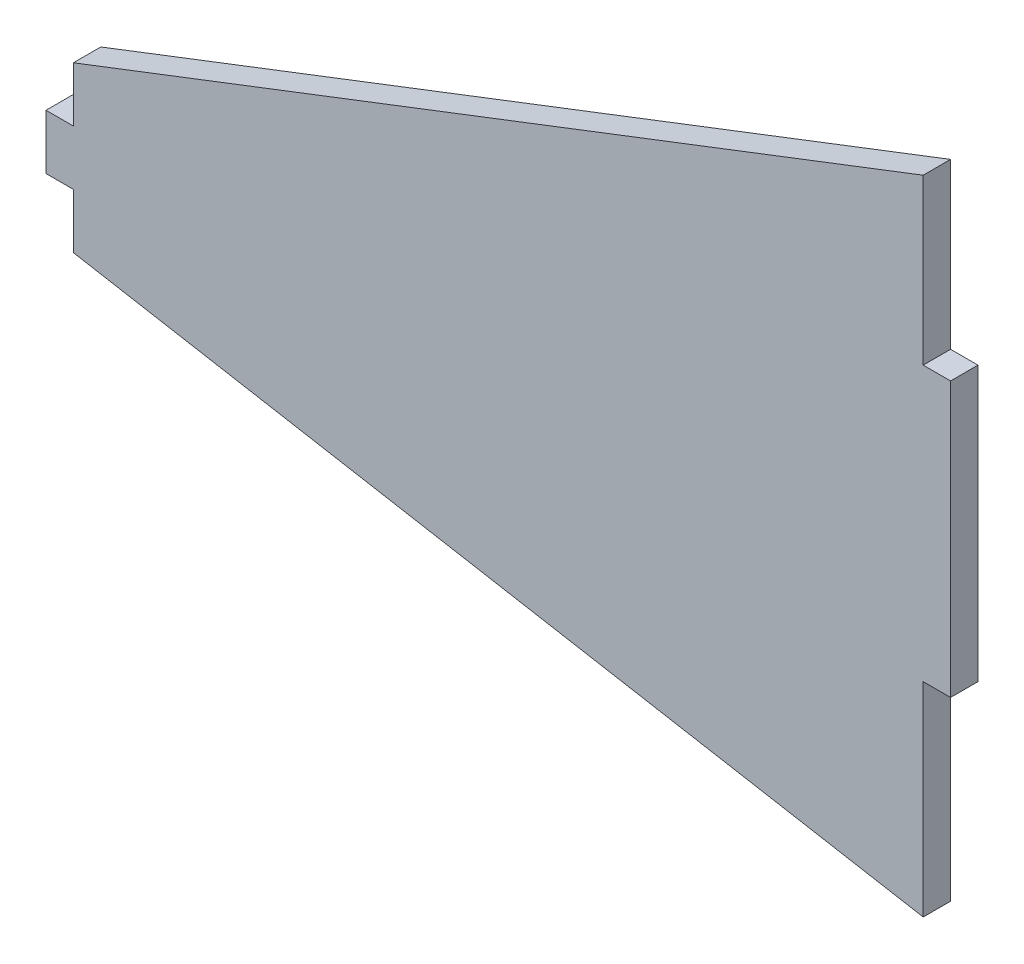
ISO-10303-21;
HEADER;
FILE_DESCRIPTION(('STEP AP214'),'2;1');
FILE_NAME('part.step','',(''),(''),'','','');
FILE_SCHEMA(('AUTOMOTIVE_DESIGN { 1 0 10303 214 1 1 1 1 }'));
ENDSEC;
DATA;
#1=APPLICATION_CONTEXT('core data for automotive mechanical design processes');
#2=APPLICATION_PROTOCOL_DEFINITION('international standard','automotive_design',2000,#1);
#3=PRODUCT_CONTEXT('',#1,'mechanical');
#4=PRODUCT('Part','Part','',(#3));
#5=PRODUCT_RELATED_PRODUCT_CATEGORY('part','',(#4));
#6=PRODUCT_DEFINITION_FORMATION('','',#4);
#7=PRODUCT_DEFINITION_CONTEXT('part definition',#1,'design');
#8=PRODUCT_DEFINITION('design','',#6,#7);
#9=PRODUCT_DEFINITION_SHAPE('','',#8);
#10=(LENGTH_UNIT() NAMED_UNIT(*) SI_UNIT(.MILLI.,.METRE.));
#11=(NAMED_UNIT(*) PLANE_ANGLE_UNIT() SI_UNIT($,.RADIAN.));
#12=(NAMED_UNIT(*) SI_UNIT($,.STERADIAN.) SOLID_ANGLE_UNIT());
#13=UNCERTAINTY_MEASURE_WITH_UNIT(LENGTH_MEASURE(1.E-05),#10,'distance_accuracy_value','');
#14=(GEOMETRIC_REPRESENTATION_CONTEXT(3) GLOBAL_UNCERTAINTY_ASSIGNED_CONTEXT((#13)) GLOBAL_UNIT_ASSIGNED_CONTEXT((#10,
#11,#12)) REPRESENTATION_CONTEXT('',''));
#15=CARTESIAN_POINT('',(0.,0.,0.));
#16=DIRECTION('',(0.,0.,1.));
#17=DIRECTION('',(1.,0.,0.));
#18=AXIS2_PLACEMENT_3D('',#15,#16,#17);
#19=CARTESIAN_POINT('',(0.,0.,3.175));
#20=DIRECTION('',(-1.,0.,0.));
#21=DIRECTION('',(0.,-1.,0.));
#22=AXIS2_PLACEMENT_3D('',#19,#20,#21);
#23=PLANE('',#22);
#24=DIRECTION('',(0.,1.,0.));
#25=VECTOR('',#24,1.);
#26=CARTESIAN_POINT('',(0.,0.,0.));
#27=LINE('',#26,#25);
#28=CARTESIAN_POINT('',(0.,3.175,0.));
#29=VERTEX_POINT('',#28);
#30=CARTESIAN_POINT('',(0.,9.525,0.));
#31=VERTEX_POINT('',#30);
#32=EDGE_CURVE('E62',#29,#31,#27,.T.);
#33=ORIENTED_EDGE('',*,*,#32,.F.);
#34=DIRECTION('',(0.,0.,1.));
#35=VECTOR('',#34,1.);
#36=CARTESIAN_POINT('',(0.,3.175,-7.09951582856183));
#37=LINE('',#36,#35);
#38=CARTESIAN_POINT('',(0.,3.175,3.175));
#39=VERTEX_POINT('',#38);
#40=EDGE_CURVE('E57',#29,#39,#37,.T.);
#41=ORIENTED_EDGE('',*,*,#40,.T.);
#42=DIRECTION('',(0.,1.,0.));
#43=VECTOR('',#42,1.);
#44=CARTESIAN_POINT('',(0.,0.,3.175));
#45=LINE('',#44,#43);
#46=CARTESIAN_POINT('',(0.,9.525,3.175));
#47=VERTEX_POINT('',#46);
#48=EDGE_CURVE('E154',#39,#47,#45,.T.);
#49=ORIENTED_EDGE('',*,*,#48,.T.);
#50=DIRECTION('',(0.,0.,-1.));
#51=VECTOR('',#50,1.);
#52=CARTESIAN_POINT('',(0.,9.525,3.175));
#53=LINE('',#52,#51);
#54=EDGE_CURVE('E231',#47,#31,#53,.T.);
#55=ORIENTED_EDGE('',*,*,#54,.T.);
#56=EDGE_LOOP('',(#33,#41,#49,#55));
#57=FACE_BOUND('',#56,.T.);
#58=ADVANCED_FACE('F41',(#57),#23,.T.);
#59=CARTESIAN_POINT('',(-1.63543542774568,-9.2353913704308,3.175));
#60=DIRECTION('',(-0.174370598056504,-0.984680097561343,0.));
#61=DIRECTION('',(0.984680097561344,-0.174370598056504,0.));
#62=AXIS2_PLACEMENT_3D('',#59,#60,#61);
#63=PLANE('',#62);
#64=DIRECTION('',(-0.984680097561344,0.174370598056504,0.));
#65=VECTOR('',#64,1.);
#66=CARTESIAN_POINT('',(-1.63543542774568,-9.2353913704308,0.));
#67=LINE('',#66,#65);
#68=CARTESIAN_POINT('',(98.425,-26.9544434875,0.));
#69=VERTEX_POINT('',#68);
#70=CARTESIAN_POINT('',(0.,-9.525,0.));
#71=VERTEX_POINT('',#70);
#72=EDGE_CURVE('E174',#69,#71,#67,.T.);
#73=ORIENTED_EDGE('',*,*,#72,.F.);
#74=DIRECTION('',(0.,0.,-1.));
#75=VECTOR('',#74,1.);
#76=CARTESIAN_POINT('',(98.425,-26.9544434875,3.175));
#77=LINE('',#76,#75);
#78=CARTESIAN_POINT('',(98.425,-26.9544434875,3.175));
#79=VERTEX_POINT('',#78);
#80=EDGE_CURVE('E11',#79,#69,#77,.T.);
#81=ORIENTED_EDGE('',*,*,#80,.F.);
#82=DIRECTION('',(-0.984680097561344,0.174370598056504,0.));
#83=VECTOR('',#82,1.);
#84=CARTESIAN_POINT('',(-1.63543542774568,-9.2353913704308,3.175));
#85=LINE('',#84,#83);
#86=CARTESIAN_POINT('',(0.,-9.525,3.175));
#87=VERTEX_POINT('',#86);
#88=EDGE_CURVE('E175',#79,#87,#85,.T.);
#89=ORIENTED_EDGE('',*,*,#88,.T.);
#90=DIRECTION('',(0.,0.,-1.));
#91=VECTOR('',#90,1.);
#92=CARTESIAN_POINT('',(0.,-9.525,3.175));
#93=LINE('',#92,#91);
#94=EDGE_CURVE('E202',#87,#71,#93,.T.);
#95=ORIENTED_EDGE('',*,*,#94,.T.);
#96=EDGE_LOOP('',(#73,#81,#89,#95));
#97=FACE_BOUND('',#96,.T.);
#98=ADVANCED_FACE('F43',(#97),#63,.T.);
#99=CARTESIAN_POINT('',(98.425,0.,3.175));
#100=DIRECTION('',(-1.,0.,0.));
#101=DIRECTION('',(0.,0.,1.));
#102=AXIS2_PLACEMENT_3D('',#99,#100,#101);
#103=PLANE('',#102);
#104=DIRECTION('',(0.,1.,0.));
#105=VECTOR('',#104,1.);
#106=CARTESIAN_POINT('',(98.425,0.,0.));
#107=LINE('',#106,#105);
#108=CARTESIAN_POINT('',(98.425,-3.34038098749999,0.));
#109=VERTEX_POINT('',#108);
#110=EDGE_CURVE('E206',#69,#109,#107,.T.);
#111=ORIENTED_EDGE('',*,*,#110,.T.);
#112=DIRECTION('',(0.,0.,-1.));
#113=VECTOR('',#112,1.);
#114=CARTESIAN_POINT('',(98.425,-3.34038098749999,3.175));
#115=LINE('',#114,#113);
#116=CARTESIAN_POINT('',(98.425,-3.34038098749999,3.175));
#117=VERTEX_POINT('',#116);
#118=EDGE_CURVE('E50',#117,#109,#115,.T.);
#119=ORIENTED_EDGE('',*,*,#118,.F.);
#120=DIRECTION('',(0.,1.,0.));
#121=VECTOR('',#120,1.);
#122=CARTESIAN_POINT('',(98.425,0.,3.175));
#123=LINE('',#122,#121);
#124=EDGE_CURVE('E179',#79,#117,#123,.T.);
#125=ORIENTED_EDGE('',*,*,#124,.F.);
#126=ORIENTED_EDGE('',*,*,#80,.T.);
#127=EDGE_LOOP('',(#111,#119,#125,#126));
#128=FACE_BOUND('',#127,.T.);
#129=ADVANCED_FACE('F287',(#128),#103,.F.);
#130=CARTESIAN_POINT('',(0.,-3.34038098749999,3.175));
#131=DIRECTION('',(0.,1.,0.));
#132=DIRECTION('',(0.,0.,1.));
#133=AXIS2_PLACEMENT_3D('',#130,#131,#132);
#134=PLANE('',#133);
#135=DIRECTION('',(1.,0.,0.));
#136=VECTOR('',#135,1.);
#137=CARTESIAN_POINT('',(0.,-3.34038098749999,0.));
#138=LINE('',#137,#136);
#139=CARTESIAN_POINT('',(101.6,-3.34038098749999,0.));
#140=VERTEX_POINT('',#139);
#141=EDGE_CURVE('E209',#109,#140,#138,.T.);
#142=ORIENTED_EDGE('',*,*,#141,.T.);
#143=DIRECTION('',(0.,0.,-1.));
#144=VECTOR('',#143,1.);
#145=CARTESIAN_POINT('',(101.6,-3.34038098749999,3.175));
#146=LINE('',#145,#144);
#147=CARTESIAN_POINT('',(101.6,-3.34038098749999,3.175));
#148=VERTEX_POINT('',#147);
#149=EDGE_CURVE('E243',#148,#140,#146,.T.);
#150=ORIENTED_EDGE('',*,*,#149,.F.);
#151=DIRECTION('',(1.,0.,0.));
#152=VECTOR('',#151,1.);
#153=CARTESIAN_POINT('',(0.,-3.34038098749999,3.175));
#154=LINE('',#153,#152);
#155=EDGE_CURVE('E183',#117,#148,#154,.T.);
#156=ORIENTED_EDGE('',*,*,#155,.F.);
#157=ORIENTED_EDGE('',*,*,#118,.T.);
#158=EDGE_LOOP('',(#142,#150,#156,#157));
#159=FACE_BOUND('',#158,.T.);
#160=ADVANCED_FACE('F251',(#159),#134,.F.);
#161=CARTESIAN_POINT('',(101.6,0.,3.175));
#162=DIRECTION('',(1.,0.,0.));
#163=DIRECTION('',(0.,1.,0.));
#164=AXIS2_PLACEMENT_3D('',#161,#162,#163);
#165=PLANE('',#164);
#166=DIRECTION('',(0.,-1.,0.));
#167=VECTOR('',#166,1.);
#168=CARTESIAN_POINT('',(101.6,0.,0.));
#169=LINE('',#168,#167);
#170=CARTESIAN_POINT('',(101.6,28.4096190125,0.));
#171=VERTEX_POINT('',#170);
#172=EDGE_CURVE('E214',#171,#140,#169,.T.);
#173=ORIENTED_EDGE('',*,*,#172,.F.);
#174=DIRECTION('',(0.,0.,-1.));
#175=VECTOR('',#174,1.);
#176=CARTESIAN_POINT('',(101.6,28.4096190125,3.175));
#177=LINE('',#176,#175);
#178=CARTESIAN_POINT('',(101.6,28.4096190125,3.175));
#179=VERTEX_POINT('',#178);
#180=EDGE_CURVE('E240',#179,#171,#177,.T.);
#181=ORIENTED_EDGE('',*,*,#180,.F.);
#182=DIRECTION('',(0.,-1.,0.));
#183=VECTOR('',#182,1.);
#184=CARTESIAN_POINT('',(101.6,0.,3.175));
#185=LINE('',#184,#183);
#186=EDGE_CURVE('E187',#179,#148,#185,.T.);
#187=ORIENTED_EDGE('',*,*,#186,.T.);
#188=ORIENTED_EDGE('',*,*,#149,.T.);
#189=EDGE_LOOP('',(#173,#181,#187,#188));
#190=FACE_BOUND('',#189,.T.);
#191=ADVANCED_FACE('F263',(#190),#165,.T.);
#192=CARTESIAN_POINT('',(0.,28.4096190125,3.175));
#193=DIRECTION('',(0.,1.,0.));
#194=DIRECTION('',(0.,0.,1.));
#195=AXIS2_PLACEMENT_3D('',#192,#193,#194);
#196=PLANE('',#195);
#197=DIRECTION('',(1.,0.,0.));
#198=VECTOR('',#197,1.);
#199=CARTESIAN_POINT('',(0.,28.4096190125,0.));
#200=LINE('',#199,#198);
#201=CARTESIAN_POINT('',(98.425,28.4096190125,0.));
#202=VERTEX_POINT('',#201);
#203=EDGE_CURVE('E218',#202,#171,#200,.T.);
#204=ORIENTED_EDGE('',*,*,#203,.F.);
#205=DIRECTION('',(0.,0.,-1.));
#206=VECTOR('',#205,1.);
#207=CARTESIAN_POINT('',(98.425,28.4096190125,3.175));
#208=LINE('',#207,#206);
#209=CARTESIAN_POINT('',(98.425,28.4096190125,3.175));
#210=VERTEX_POINT('',#209);
#211=EDGE_CURVE('E237',#210,#202,#208,.T.);
#212=ORIENTED_EDGE('',*,*,#211,.F.);
#213=DIRECTION('',(1.,0.,0.));
#214=VECTOR('',#213,1.);
#215=CARTESIAN_POINT('',(0.,28.4096190125,3.175));
#216=LINE('',#215,#214);
#217=EDGE_CURVE('E191',#210,#179,#216,.T.);
#218=ORIENTED_EDGE('',*,*,#217,.T.);
#219=ORIENTED_EDGE('',*,*,#180,.T.);
#220=EDGE_LOOP('',(#204,#212,#218,#219));
#221=FACE_BOUND('',#220,.T.);
#222=ADVANCED_FACE('F267',(#221),#196,.T.);
#223=CARTESIAN_POINT('',(98.425,47.4596190125,0.));
#224=VERTEX_POINT('',#223);
#225=EDGE_CURVE('E210',#202,#224,#107,.T.);
#226=ORIENTED_EDGE('',*,*,#225,.T.);
#227=DIRECTION('',(0.,0.,-1.));
#228=VECTOR('',#227,1.);
#229=CARTESIAN_POINT('',(98.425,47.4596190125,3.175));
#230=LINE('',#229,#228);
#231=CARTESIAN_POINT('',(98.425,47.4596190125,3.175));
#232=VERTEX_POINT('',#231);
#233=EDGE_CURVE('E234',#232,#224,#230,.T.);
#234=ORIENTED_EDGE('',*,*,#233,.F.);
#235=EDGE_CURVE('E184',#210,#232,#123,.T.);
#236=ORIENTED_EDGE('',*,*,#235,.F.);
#237=ORIENTED_EDGE('',*,*,#211,.T.);
#238=EDGE_LOOP('',(#226,#234,#236,#237));
#239=FACE_BOUND('',#238,.T.);
#240=ADVANCED_FACE('F272',(#239),#103,.F.);
#241=CARTESIAN_POINT('',(-3.19629562154116,8.29309492858028,3.175));
#242=DIRECTION('',(-0.359630179164444,0.933094922413658,0.));
#243=DIRECTION('',(-0.933094922413658,-0.359630179164444,0.));
#244=AXIS2_PLACEMENT_3D('',#241,#242,#243);
#245=PLANE('',#244);
#246=DIRECTION('',(0.933094922413658,0.359630179164444,0.));
#247=VECTOR('',#246,1.);
#248=CARTESIAN_POINT('',(-3.19629562154116,8.29309492858028,0.));
#249=LINE('',#248,#247);
#250=EDGE_CURVE('E222',#31,#224,#249,.T.);
#251=ORIENTED_EDGE('',*,*,#250,.F.);
#252=ORIENTED_EDGE('',*,*,#54,.F.);
#253=DIRECTION('',(0.933094922413658,0.359630179164444,0.));
#254=VECTOR('',#253,1.);
#255=CARTESIAN_POINT('',(-3.19629562154116,8.29309492858028,3.175));
#256=LINE('',#255,#254);
#257=EDGE_CURVE('E195',#47,#232,#256,.T.);
#258=ORIENTED_EDGE('',*,*,#257,.T.);
#259=ORIENTED_EDGE('',*,*,#233,.T.);
#260=EDGE_LOOP('',(#251,#252,#258,#259));
#261=FACE_BOUND('',#260,.T.);
#262=ADVANCED_FACE('F297',(#261),#245,.T.);
#263=DIRECTION('',(0.,0.,1.));
#264=VECTOR('',#263,1.);
#265=CARTESIAN_POINT('',(0.,-3.175,-7.09951582856183));
#266=LINE('',#265,#264);
#267=CARTESIAN_POINT('',(0.,-3.175,0.));
#268=VERTEX_POINT('',#267);
#269=CARTESIAN_POINT('',(0.,-3.175,3.175));
#270=VERTEX_POINT('',#269);
#271=EDGE_CURVE('E163',#268,#270,#266,.T.);
#272=ORIENTED_EDGE('',*,*,#271,.F.);
#273=EDGE_CURVE('E180',#71,#268,#27,.T.);
#274=ORIENTED_EDGE('',*,*,#273,.F.);
#275=ORIENTED_EDGE('',*,*,#94,.F.);
#276=EDGE_CURVE('E199',#87,#270,#45,.T.);
#277=ORIENTED_EDGE('',*,*,#276,.T.);
#278=EDGE_LOOP('',(#272,#274,#275,#277));
#279=FACE_BOUND('',#278,.T.);
#280=ADVANCED_FACE('F284',(#279),#23,.T.);
#281=CARTESIAN_POINT('',(0.,0.,3.175));
#282=DIRECTION('',(0.,0.,1.));
#283=DIRECTION('',(1.,0.,0.));
#284=AXIS2_PLACEMENT_3D('',#281,#282,#283);
#285=PLANE('',#284);
#286=ORIENTED_EDGE('',*,*,#88,.F.);
#287=ORIENTED_EDGE('',*,*,#124,.T.);
#288=ORIENTED_EDGE('',*,*,#155,.T.);
#289=ORIENTED_EDGE('',*,*,#186,.F.);
#290=ORIENTED_EDGE('',*,*,#217,.F.);
#291=ORIENTED_EDGE('',*,*,#235,.T.);
#292=ORIENTED_EDGE('',*,*,#257,.F.);
#293=ORIENTED_EDGE('',*,*,#48,.F.);
#294=DIRECTION('',(-1.,0.,0.));
#295=VECTOR('',#294,1.);
#296=CARTESIAN_POINT('',(0.,3.175,3.175));
#297=LINE('',#296,#295);
#298=CARTESIAN_POINT('',(-3.175,3.175,3.175));
#299=VERTEX_POINT('',#298);
#300=EDGE_CURVE('E134',#39,#299,#297,.T.);
#301=ORIENTED_EDGE('',*,*,#300,.T.);
#302=DIRECTION('',(0.,-1.,0.));
#303=VECTOR('',#302,1.);
#304=CARTESIAN_POINT('',(-3.175,3.175,3.175));
#305=LINE('',#304,#303);
#306=CARTESIAN_POINT('',(-3.175,-3.175,3.175));
#307=VERTEX_POINT('',#306);
#308=EDGE_CURVE('E142',#299,#307,#305,.T.);
#309=ORIENTED_EDGE('',*,*,#308,.T.);
#310=DIRECTION('',(1.,0.,0.));
#311=VECTOR('',#310,1.);
#312=CARTESIAN_POINT('',(0.,-3.175,3.175));
#313=LINE('',#312,#311);
#314=EDGE_CURVE('E149',#307,#270,#313,.T.);
#315=ORIENTED_EDGE('',*,*,#314,.T.);
#316=ORIENTED_EDGE('',*,*,#276,.F.);
#317=EDGE_LOOP('',(#286,#287,#288,#289,#290,#291,#292,#293,#301,#309,#315,#316));
#318=FACE_BOUND('',#317,.T.);
#319=ADVANCED_FACE('F152',(#318),#285,.T.);
#320=CARTESIAN_POINT('',(0.,0.,0.));
#321=DIRECTION('',(0.,0.,1.));
#322=DIRECTION('',(1.,0.,0.));
#323=AXIS2_PLACEMENT_3D('',#320,#321,#322);
#324=PLANE('',#323);
#325=ORIENTED_EDGE('',*,*,#72,.T.);
#326=ORIENTED_EDGE('',*,*,#273,.T.);
#327=DIRECTION('',(-1.,0.,0.));
#328=VECTOR('',#327,1.);
#329=CARTESIAN_POINT('',(0.,-3.175,0.));
#330=LINE('',#329,#328);
#331=CARTESIAN_POINT('',(-3.175,-3.175,0.));
#332=VERTEX_POINT('',#331);
#333=EDGE_CURVE('E158',#268,#332,#330,.T.);
#334=ORIENTED_EDGE('',*,*,#333,.T.);
#335=DIRECTION('',(0.,1.,0.));
#336=VECTOR('',#335,1.);
#337=CARTESIAN_POINT('',(-3.175,3.175,0.));
#338=LINE('',#337,#336);
#339=CARTESIAN_POINT('',(-3.175,3.175,0.));
#340=VERTEX_POINT('',#339);
#341=EDGE_CURVE('E167',#332,#340,#338,.T.);
#342=ORIENTED_EDGE('',*,*,#341,.T.);
#343=DIRECTION('',(1.,0.,0.));
#344=VECTOR('',#343,1.);
#345=CARTESIAN_POINT('',(0.,3.175,0.));
#346=LINE('',#345,#344);
#347=EDGE_CURVE('E135',#340,#29,#346,.T.);
#348=ORIENTED_EDGE('',*,*,#347,.T.);
#349=ORIENTED_EDGE('',*,*,#32,.T.);
#350=ORIENTED_EDGE('',*,*,#250,.T.);
#351=ORIENTED_EDGE('',*,*,#225,.F.);
#352=ORIENTED_EDGE('',*,*,#203,.T.);
#353=ORIENTED_EDGE('',*,*,#172,.T.);
#354=ORIENTED_EDGE('',*,*,#141,.F.);
#355=ORIENTED_EDGE('',*,*,#110,.F.);
#356=EDGE_LOOP('',(#325,#326,#334,#342,#348,#349,#350,#351,#352,#353,#354,#355));
#357=FACE_BOUND('',#356,.T.);
#358=ADVANCED_FACE('F257',(#357),#324,.F.);
#359=CARTESIAN_POINT('',(0.,-3.175,-7.09951582856183));
#360=DIRECTION('',(0.,-1.,0.));
#361=DIRECTION('',(1.,0.,0.));
#362=AXIS2_PLACEMENT_3D('',#359,#360,#361);
#363=PLANE('',#362);
#364=ORIENTED_EDGE('',*,*,#333,.F.);
#365=ORIENTED_EDGE('',*,*,#271,.T.);
#366=ORIENTED_EDGE('',*,*,#314,.F.);
#367=DIRECTION('',(0.,0.,1.));
#368=VECTOR('',#367,1.);
#369=CARTESIAN_POINT('',(-3.175,-3.175,-7.09951582856183));
#370=LINE('',#369,#368);
#371=EDGE_CURVE('E139',#332,#307,#370,.T.);
#372=ORIENTED_EDGE('',*,*,#371,.F.);
#373=EDGE_LOOP('',(#364,#365,#366,#372));
#374=FACE_BOUND('',#373,.T.);
#375=ADVANCED_FACE('F281',(#374),#363,.T.);
#376=CARTESIAN_POINT('',(-3.175,3.175,-7.09951582856183));
#377=DIRECTION('',(-1.,0.,0.));
#378=DIRECTION('',(0.,-1.,0.));
#379=AXIS2_PLACEMENT_3D('',#376,#377,#378);
#380=PLANE('',#379);
#381=ORIENTED_EDGE('',*,*,#341,.F.);
#382=ORIENTED_EDGE('',*,*,#371,.T.);
#383=ORIENTED_EDGE('',*,*,#308,.F.);
#384=DIRECTION('',(0.,0.,1.));
#385=VECTOR('',#384,1.);
#386=CARTESIAN_POINT('',(-3.175,3.175,-7.09951582856183));
#387=LINE('',#386,#385);
#388=EDGE_CURVE('E130',#340,#299,#387,.T.);
#389=ORIENTED_EDGE('',*,*,#388,.F.);
#390=EDGE_LOOP('',(#381,#382,#383,#389));
#391=FACE_BOUND('',#390,.T.);
#392=ADVANCED_FACE('F143',(#391),#380,.T.);
#393=CARTESIAN_POINT('',(0.,3.175,-7.09951582856183));
#394=DIRECTION('',(0.,1.,0.));
#395=DIRECTION('',(-1.,0.,0.));
#396=AXIS2_PLACEMENT_3D('',#393,#394,#395);
#397=PLANE('',#396);
#398=ORIENTED_EDGE('',*,*,#347,.F.);
#399=ORIENTED_EDGE('',*,*,#388,.T.);
#400=ORIENTED_EDGE('',*,*,#300,.F.);
#401=ORIENTED_EDGE('',*,*,#40,.F.);
#402=EDGE_LOOP('',(#398,#399,#400,#401));
#403=FACE_BOUND('',#402,.T.);
#404=ADVANCED_FACE('F132',(#403),#397,.T.);
#405=CLOSED_SHELL('',(#58,#98,#129,#160,#191,#222,#240,#262,#280,#319,#358,#375,#392,#404));
#406=MANIFOLD_SOLID_BREP('B2',#405);
#407=ADVANCED_BREP_SHAPE_REPRESENTATION('',(#18,#406),#14);
#408=SHAPE_DEFINITION_REPRESENTATION(#9,#407);
ENDSEC;
END-ISO-10303-21;
